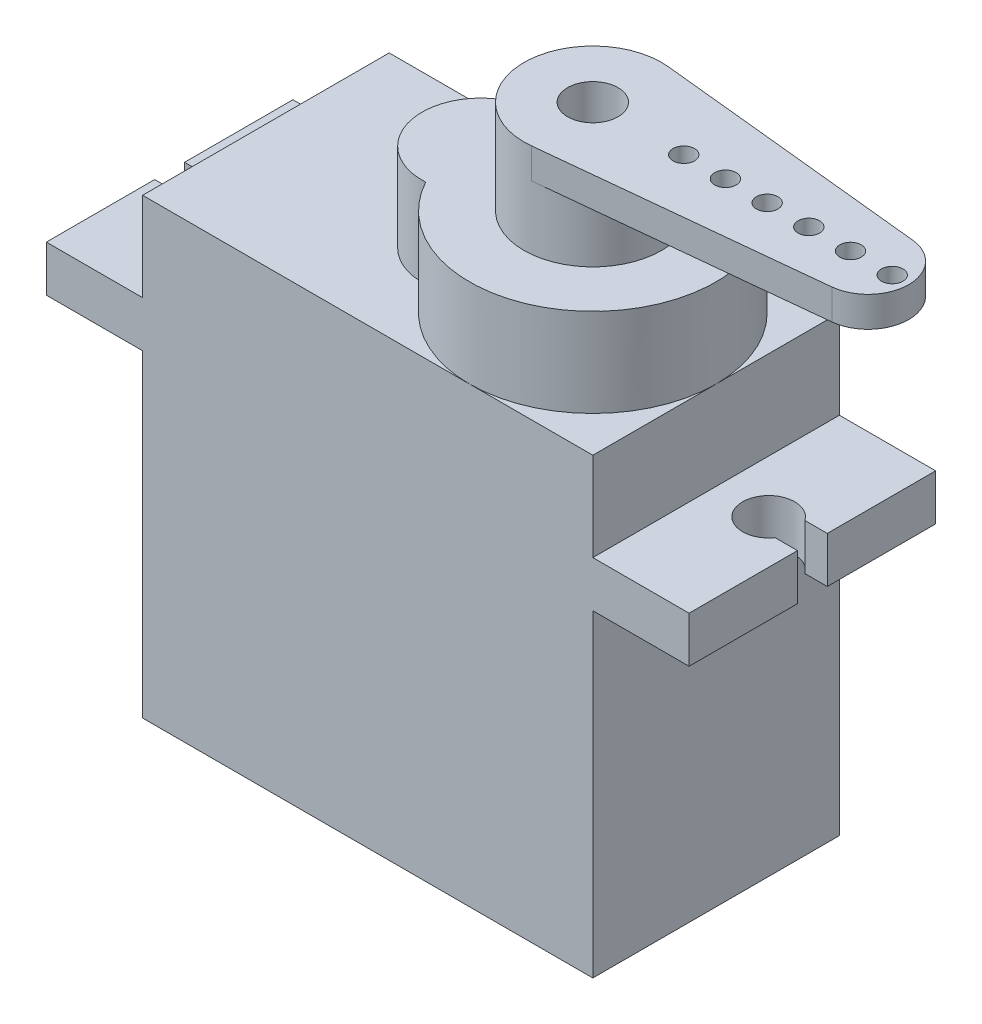
ISO-10303-21;
HEADER;
FILE_DESCRIPTION(('STEP AP214'),'2;1');
FILE_NAME('part.step','',(''),(''),'','','');
FILE_SCHEMA(('AUTOMOTIVE_DESIGN { 1 0 10303 214 1 1 1 1 }'));
ENDSEC;
DATA;
#1=APPLICATION_CONTEXT('core data for automotive mechanical design processes');
#2=APPLICATION_PROTOCOL_DEFINITION('international standard','automotive_design',2000,#1);
#3=PRODUCT_CONTEXT('',#1,'mechanical');
#4=PRODUCT('Part','Part','',(#3));
#5=PRODUCT_RELATED_PRODUCT_CATEGORY('part','',(#4));
#6=PRODUCT_DEFINITION_FORMATION('','',#4);
#7=PRODUCT_DEFINITION_CONTEXT('part definition',#1,'design');
#8=PRODUCT_DEFINITION('design','',#6,#7);
#9=PRODUCT_DEFINITION_SHAPE('','',#8);
#10=(LENGTH_UNIT() NAMED_UNIT(*) SI_UNIT(.MILLI.,.METRE.));
#11=(NAMED_UNIT(*) PLANE_ANGLE_UNIT() SI_UNIT($,.RADIAN.));
#12=(NAMED_UNIT(*) SI_UNIT($,.STERADIAN.) SOLID_ANGLE_UNIT());
#13=UNCERTAINTY_MEASURE_WITH_UNIT(LENGTH_MEASURE(1.E-05),#10,'distance_accuracy_value','');
#14=(GEOMETRIC_REPRESENTATION_CONTEXT(3) GLOBAL_UNCERTAINTY_ASSIGNED_CONTEXT((#13)) GLOBAL_UNIT_ASSIGNED_CONTEXT((#10,
#11,#12)) REPRESENTATION_CONTEXT('',''));
#15=CARTESIAN_POINT('',(0.,0.,0.));
#16=DIRECTION('',(0.,0.,1.));
#17=DIRECTION('',(1.,0.,0.));
#18=AXIS2_PLACEMENT_3D('',#15,#16,#17);
#19=CARTESIAN_POINT('',(11.3157,22.7584,6.1976));
#20=DIRECTION('',(-1.,0.,0.));
#21=DIRECTION('',(0.,0.,1.));
#22=AXIS2_PLACEMENT_3D('',#19,#20,#21);
#23=PLANE('',#22);
#24=DIRECTION('',(0.,0.,-1.));
#25=VECTOR('',#24,1.);
#26=CARTESIAN_POINT('',(11.3157,15.9893,6.1976));
#27=LINE('',#26,#25);
#28=CARTESIAN_POINT('',(11.3157,15.9893,6.1976));
#29=VERTEX_POINT('',#28);
#30=CARTESIAN_POINT('',(11.3157,15.9893,-6.1976));
#31=VERTEX_POINT('',#30);
#32=EDGE_CURVE('E242',#29,#31,#27,.T.);
#33=ORIENTED_EDGE('',*,*,#32,.F.);
#34=DIRECTION('',(0.,-1.,0.));
#35=VECTOR('',#34,1.);
#36=CARTESIAN_POINT('',(11.3157,22.7584,6.1976));
#37=LINE('',#36,#35);
#38=CARTESIAN_POINT('',(11.3157,0.,6.1976));
#39=VERTEX_POINT('',#38);
#40=EDGE_CURVE('E444',#29,#39,#37,.T.);
#41=ORIENTED_EDGE('',*,*,#40,.T.);
#42=DIRECTION('',(0.,0.,-1.));
#43=VECTOR('',#42,1.);
#44=CARTESIAN_POINT('',(11.3157,0.,6.1976));
#45=LINE('',#44,#43);
#46=CARTESIAN_POINT('',(11.3157,0.,-6.1976));
#47=VERTEX_POINT('',#46);
#48=EDGE_CURVE('E429',#39,#47,#45,.T.);
#49=ORIENTED_EDGE('',*,*,#48,.T.);
#50=DIRECTION('',(0.,-1.,0.));
#51=VECTOR('',#50,1.);
#52=CARTESIAN_POINT('',(11.3157,22.7584,-6.1976));
#53=LINE('',#52,#51);
#54=EDGE_CURVE('E466',#31,#47,#53,.T.);
#55=ORIENTED_EDGE('',*,*,#54,.F.);
#56=EDGE_LOOP('',(#33,#41,#49,#55));
#57=FACE_BOUND('',#56,.T.);
#58=ADVANCED_FACE('F41',(#57),#23,.F.);
#59=CARTESIAN_POINT('',(-11.3157,22.7584,6.1976));
#60=DIRECTION('',(1.,0.,0.));
#61=DIRECTION('',(0.,0.,-1.));
#62=AXIS2_PLACEMENT_3D('',#59,#60,#61);
#63=PLANE('',#62);
#64=DIRECTION('',(0.,0.,1.));
#65=VECTOR('',#64,1.);
#66=CARTESIAN_POINT('',(-11.3157,15.9893,6.1976));
#67=LINE('',#66,#65);
#68=CARTESIAN_POINT('',(-11.3157,15.9893,-6.1976));
#69=VERTEX_POINT('',#68);
#70=CARTESIAN_POINT('',(-11.3157,15.9893,6.1976));
#71=VERTEX_POINT('',#70);
#72=EDGE_CURVE('E339',#69,#71,#67,.T.);
#73=ORIENTED_EDGE('',*,*,#72,.F.);
#74=DIRECTION('',(0.,-1.,0.));
#75=VECTOR('',#74,1.);
#76=CARTESIAN_POINT('',(-11.3157,22.7584,-6.1976));
#77=LINE('',#76,#75);
#78=CARTESIAN_POINT('',(-11.3157,0.,-6.1976));
#79=VERTEX_POINT('',#78);
#80=EDGE_CURVE('E463',#69,#79,#77,.T.);
#81=ORIENTED_EDGE('',*,*,#80,.T.);
#82=DIRECTION('',(0.,0.,1.));
#83=VECTOR('',#82,1.);
#84=CARTESIAN_POINT('',(-11.3157,0.,6.1976));
#85=LINE('',#84,#83);
#86=CARTESIAN_POINT('',(-11.3157,0.,6.1976));
#87=VERTEX_POINT('',#86);
#88=EDGE_CURVE('E450',#79,#87,#85,.T.);
#89=ORIENTED_EDGE('',*,*,#88,.T.);
#90=DIRECTION('',(0.,-1.,0.));
#91=VECTOR('',#90,1.);
#92=CARTESIAN_POINT('',(-11.3157,22.7584,6.1976));
#93=LINE('',#92,#91);
#94=EDGE_CURVE('E459',#71,#87,#93,.T.);
#95=ORIENTED_EDGE('',*,*,#94,.F.);
#96=EDGE_LOOP('',(#73,#81,#89,#95));
#97=FACE_BOUND('',#96,.T.);
#98=ADVANCED_FACE('F487',(#97),#63,.F.);
#99=CARTESIAN_POINT('',(0.,22.7584,0.));
#100=DIRECTION('',(0.,-1.,0.));
#101=DIRECTION('',(0.,0.,-1.));
#102=AXIS2_PLACEMENT_3D('',#99,#100,#101);
#103=PLANE('',#102);
#104=CARTESIAN_POINT('',(-0.507999999999997,22.7584,0.));
#105=DIRECTION('',(0.,1.,0.));
#106=DIRECTION('',(0.,0.,1.));
#107=AXIS2_PLACEMENT_3D('',#104,#105,#106);
#108=CIRCLE('',#107,2.9591);
#109=CARTESIAN_POINT('',(-0.330343340857782,22.7584,-2.95376216399738));
#110=VERTEX_POINT('',#109);
#111=CARTESIAN_POINT('',(-0.330343340857786,22.7584,2.95376216399737));
#112=VERTEX_POINT('',#111);
#113=EDGE_CURVE('E408',#110,#112,#108,.T.);
#114=ORIENTED_EDGE('',*,*,#113,.F.);
#115=CARTESIAN_POINT('',(5.1181,22.7584,0.));
#116=DIRECTION('',(0.,1.,0.));
#117=DIRECTION('',(0.,0.,1.));
#118=AXIS2_PLACEMENT_3D('',#115,#116,#117);
#119=CIRCLE('',#118,6.1976);
#120=CARTESIAN_POINT('',(5.1181,22.7584,-6.1976));
#121=VERTEX_POINT('',#120);
#122=EDGE_CURVE('E423',#121,#110,#119,.T.);
#123=ORIENTED_EDGE('',*,*,#122,.F.);
#124=DIRECTION('',(-1.,0.,0.));
#125=VECTOR('',#124,1.);
#126=CARTESIAN_POINT('',(-11.3157,22.7584,-6.1976));
#127=LINE('',#126,#125);
#128=CARTESIAN_POINT('',(-11.3157,22.7584,-6.1976));
#129=VERTEX_POINT('',#128);
#130=EDGE_CURVE('E433',#121,#129,#127,.T.);
#131=ORIENTED_EDGE('',*,*,#130,.T.);
#132=DIRECTION('',(0.,0.,1.));
#133=VECTOR('',#132,1.);
#134=CARTESIAN_POINT('',(-11.3157,22.7584,6.1976));
#135=LINE('',#134,#133);
#136=CARTESIAN_POINT('',(-11.3157,22.7584,6.1976));
#137=VERTEX_POINT('',#136);
#138=EDGE_CURVE('E438',#129,#137,#135,.T.);
#139=ORIENTED_EDGE('',*,*,#138,.T.);
#140=DIRECTION('',(1.,0.,0.));
#141=VECTOR('',#140,1.);
#142=CARTESIAN_POINT('',(-11.3157,22.7584,6.1976));
#143=LINE('',#142,#141);
#144=CARTESIAN_POINT('',(5.1181,22.7584,6.1976));
#145=VERTEX_POINT('',#144);
#146=EDGE_CURVE('E441',#137,#145,#143,.T.);
#147=ORIENTED_EDGE('',*,*,#146,.T.);
#148=EDGE_CURVE('E416',#112,#145,#119,.T.);
#149=ORIENTED_EDGE('',*,*,#148,.F.);
#150=EDGE_LOOP('',(#114,#123,#131,#139,#147,#149));
#151=FACE_BOUND('',#150,.T.);
#152=ADVANCED_FACE('F512',(#151),#103,.F.);
#153=CARTESIAN_POINT('',(11.3157,22.7584,0.));
#154=VERTEX_POINT('',#153);
#155=EDGE_CURVE('E411',#145,#154,#119,.T.);
#156=ORIENTED_EDGE('',*,*,#155,.F.);
#157=CARTESIAN_POINT('',(11.3157,22.7584,6.1976));
#158=VERTEX_POINT('',#157);
#159=EDGE_CURVE('E440',#145,#158,#143,.T.);
#160=ORIENTED_EDGE('',*,*,#159,.T.);
#161=DIRECTION('',(0.,0.,-1.));
#162=VECTOR('',#161,1.);
#163=CARTESIAN_POINT('',(11.3157,22.7584,6.1976));
#164=LINE('',#163,#162);
#165=EDGE_CURVE('E430',#158,#154,#164,.T.);
#166=ORIENTED_EDGE('',*,*,#165,.T.);
#167=EDGE_LOOP('',(#156,#160,#166));
#168=FACE_BOUND('',#167,.T.);
#169=ADVANCED_FACE('F523',(#168),#103,.F.);
#170=CARTESIAN_POINT('',(11.3157,18.3007,6.1976));
#171=VERTEX_POINT('',#170);
#172=EDGE_CURVE('E456',#158,#171,#37,.T.);
#173=ORIENTED_EDGE('',*,*,#172,.T.);
#174=DIRECTION('',(0.,0.,-1.));
#175=VECTOR('',#174,1.);
#176=CARTESIAN_POINT('',(11.3157,18.3007,6.1976));
#177=LINE('',#176,#175);
#178=CARTESIAN_POINT('',(11.3157,18.3007,-6.1976));
#179=VERTEX_POINT('',#178);
#180=EDGE_CURVE('E337',#171,#179,#177,.T.);
#181=ORIENTED_EDGE('',*,*,#180,.T.);
#182=CARTESIAN_POINT('',(11.3157,22.7584,-6.1976));
#183=VERTEX_POINT('',#182);
#184=EDGE_CURVE('E467',#183,#179,#53,.T.);
#185=ORIENTED_EDGE('',*,*,#184,.F.);
#186=EDGE_CURVE('E434',#154,#183,#164,.T.);
#187=ORIENTED_EDGE('',*,*,#186,.F.);
#188=ORIENTED_EDGE('',*,*,#165,.F.);
#189=EDGE_LOOP('',(#173,#181,#185,#187,#188));
#190=FACE_BOUND('',#189,.T.);
#191=ADVANCED_FACE('F43',(#190),#23,.F.);
#192=CARTESIAN_POINT('',(-11.3157,22.7584,-6.1976));
#193=DIRECTION('',(0.,0.,1.));
#194=DIRECTION('',(1.,0.,0.));
#195=AXIS2_PLACEMENT_3D('',#192,#193,#194);
#196=PLANE('',#195);
#197=ORIENTED_EDGE('',*,*,#184,.T.);
#198=DIRECTION('',(-1.,0.,0.));
#199=VECTOR('',#198,1.);
#200=CARTESIAN_POINT('',(-16.1544,18.3007,-6.1976));
#201=LINE('',#200,#199);
#202=CARTESIAN_POINT('',(16.1544,18.3007,-6.1976));
#203=VERTEX_POINT('',#202);
#204=EDGE_CURVE('E56',#203,#179,#201,.T.);
#205=ORIENTED_EDGE('',*,*,#204,.F.);
#206=DIRECTION('',(0.,1.,0.));
#207=VECTOR('',#206,1.);
#208=CARTESIAN_POINT('',(16.1544,15.9893,-6.1976));
#209=LINE('',#208,#207);
#210=CARTESIAN_POINT('',(16.1544,15.9893,-6.1976));
#211=VERTEX_POINT('',#210);
#212=EDGE_CURVE('E223',#211,#203,#209,.T.);
#213=ORIENTED_EDGE('',*,*,#212,.F.);
#214=DIRECTION('',(-1.,0.,0.));
#215=VECTOR('',#214,1.);
#216=CARTESIAN_POINT('',(-16.1544,15.9893,-6.1976));
#217=LINE('',#216,#215);
#218=EDGE_CURVE('E227',#211,#31,#217,.T.);
#219=ORIENTED_EDGE('',*,*,#218,.T.);
#220=ORIENTED_EDGE('',*,*,#54,.T.);
#221=DIRECTION('',(-1.,0.,0.));
#222=VECTOR('',#221,1.);
#223=CARTESIAN_POINT('',(-11.3157,0.,-6.1976));
#224=LINE('',#223,#222);
#225=EDGE_CURVE('E447',#47,#79,#224,.T.);
#226=ORIENTED_EDGE('',*,*,#225,.T.);
#227=ORIENTED_EDGE('',*,*,#80,.F.);
#228=CARTESIAN_POINT('',(-16.1544,15.9893,-6.1976));
#229=VERTEX_POINT('',#228);
#230=EDGE_CURVE('E244',#69,#229,#217,.T.);
#231=ORIENTED_EDGE('',*,*,#230,.T.);
#232=DIRECTION('',(0.,1.,0.));
#233=VECTOR('',#232,1.);
#234=CARTESIAN_POINT('',(-16.1544,15.9893,-6.1976));
#235=LINE('',#234,#233);
#236=CARTESIAN_POINT('',(-16.1544,18.3007,-6.1976));
#237=VERTEX_POINT('',#236);
#238=EDGE_CURVE('E232',#229,#237,#235,.T.);
#239=ORIENTED_EDGE('',*,*,#238,.T.);
#240=CARTESIAN_POINT('',(-11.3157,18.3007,-6.1976));
#241=VERTEX_POINT('',#240);
#242=EDGE_CURVE('E287',#241,#237,#201,.T.);
#243=ORIENTED_EDGE('',*,*,#242,.F.);
#244=EDGE_CURVE('E464',#129,#241,#77,.T.);
#245=ORIENTED_EDGE('',*,*,#244,.F.);
#246=ORIENTED_EDGE('',*,*,#130,.F.);
#247=EDGE_CURVE('E435',#183,#121,#127,.T.);
#248=ORIENTED_EDGE('',*,*,#247,.F.);
#249=EDGE_LOOP('',(#197,#205,#213,#219,#220,#226,#227,#231,#239,#243,#245,#246,#248));
#250=FACE_BOUND('',#249,.T.);
#251=ADVANCED_FACE('F226',(#250),#196,.F.);
#252=ORIENTED_EDGE('',*,*,#244,.T.);
#253=DIRECTION('',(0.,0.,1.));
#254=VECTOR('',#253,1.);
#255=CARTESIAN_POINT('',(-11.3157,18.3007,6.1976));
#256=LINE('',#255,#254);
#257=CARTESIAN_POINT('',(-11.3157,18.3007,6.1976));
#258=VERTEX_POINT('',#257);
#259=EDGE_CURVE('E314',#241,#258,#256,.T.);
#260=ORIENTED_EDGE('',*,*,#259,.T.);
#261=EDGE_CURVE('E460',#137,#258,#93,.T.);
#262=ORIENTED_EDGE('',*,*,#261,.F.);
#263=ORIENTED_EDGE('',*,*,#138,.F.);
#264=EDGE_LOOP('',(#252,#260,#262,#263));
#265=FACE_BOUND('',#264,.T.);
#266=ADVANCED_FACE('F508',(#265),#63,.F.);
#267=CARTESIAN_POINT('',(-11.3157,22.7584,6.1976));
#268=DIRECTION('',(0.,0.,-1.));
#269=DIRECTION('',(-1.,0.,0.));
#270=AXIS2_PLACEMENT_3D('',#267,#268,#269);
#271=PLANE('',#270);
#272=ORIENTED_EDGE('',*,*,#261,.T.);
#273=DIRECTION('',(1.,0.,0.));
#274=VECTOR('',#273,1.);
#275=CARTESIAN_POINT('',(-16.1544,18.3007,6.1976));
#276=LINE('',#275,#274);
#277=CARTESIAN_POINT('',(-16.1544,18.3007,6.1976));
#278=VERTEX_POINT('',#277);
#279=EDGE_CURVE('E64',#278,#258,#276,.T.);
#280=ORIENTED_EDGE('',*,*,#279,.F.);
#281=DIRECTION('',(0.,1.,0.));
#282=VECTOR('',#281,1.);
#283=CARTESIAN_POINT('',(-16.1544,15.9893,6.1976));
#284=LINE('',#283,#282);
#285=CARTESIAN_POINT('',(-16.1544,15.9893,6.1976));
#286=VERTEX_POINT('',#285);
#287=EDGE_CURVE('E324',#286,#278,#284,.T.);
#288=ORIENTED_EDGE('',*,*,#287,.F.);
#289=DIRECTION('',(1.,0.,0.));
#290=VECTOR('',#289,1.);
#291=CARTESIAN_POINT('',(-16.1544,15.9893,6.1976));
#292=LINE('',#291,#290);
#293=EDGE_CURVE('E272',#286,#71,#292,.T.);
#294=ORIENTED_EDGE('',*,*,#293,.T.);
#295=ORIENTED_EDGE('',*,*,#94,.T.);
#296=DIRECTION('',(1.,0.,0.));
#297=VECTOR('',#296,1.);
#298=CARTESIAN_POINT('',(-11.3157,0.,6.1976));
#299=LINE('',#298,#297);
#300=EDGE_CURVE('E453',#87,#39,#299,.T.);
#301=ORIENTED_EDGE('',*,*,#300,.T.);
#302=ORIENTED_EDGE('',*,*,#40,.F.);
#303=CARTESIAN_POINT('',(16.1544,15.9893,6.1976));
#304=VERTEX_POINT('',#303);
#305=EDGE_CURVE('E271',#29,#304,#292,.T.);
#306=ORIENTED_EDGE('',*,*,#305,.T.);
#307=DIRECTION('',(0.,1.,0.));
#308=VECTOR('',#307,1.);
#309=CARTESIAN_POINT('',(16.1544,15.9893,6.1976));
#310=LINE('',#309,#308);
#311=CARTESIAN_POINT('',(16.1544,18.3007,6.1976));
#312=VERTEX_POINT('',#311);
#313=EDGE_CURVE('E321',#304,#312,#310,.T.);
#314=ORIENTED_EDGE('',*,*,#313,.T.);
#315=EDGE_CURVE('E303',#171,#312,#276,.T.);
#316=ORIENTED_EDGE('',*,*,#315,.F.);
#317=ORIENTED_EDGE('',*,*,#172,.F.);
#318=ORIENTED_EDGE('',*,*,#159,.F.);
#319=ORIENTED_EDGE('',*,*,#146,.F.);
#320=EDGE_LOOP('',(#272,#280,#288,#294,#295,#301,#302,#306,#314,#316,#317,#318,#319));
#321=FACE_BOUND('',#320,.T.);
#322=ADVANCED_FACE('F482',(#321),#271,.F.);
#323=EDGE_CURVE('E471',#154,#121,#119,.T.);
#324=ORIENTED_EDGE('',*,*,#323,.F.);
#325=ORIENTED_EDGE('',*,*,#186,.T.);
#326=ORIENTED_EDGE('',*,*,#247,.T.);
#327=EDGE_LOOP('',(#324,#325,#326));
#328=FACE_BOUND('',#327,.T.);
#329=ADVANCED_FACE('F515',(#328),#103,.F.);
#330=CARTESIAN_POINT('',(0.,0.,0.));
#331=DIRECTION('',(0.,-1.,0.));
#332=DIRECTION('',(0.,0.,-1.));
#333=AXIS2_PLACEMENT_3D('',#330,#331,#332);
#334=PLANE('',#333);
#335=ORIENTED_EDGE('',*,*,#48,.F.);
#336=ORIENTED_EDGE('',*,*,#300,.F.);
#337=ORIENTED_EDGE('',*,*,#88,.F.);
#338=ORIENTED_EDGE('',*,*,#225,.F.);
#339=EDGE_LOOP('',(#335,#336,#337,#338));
#340=FACE_BOUND('',#339,.T.);
#341=ADVANCED_FACE('F478',(#340),#334,.T.);
#342=CARTESIAN_POINT('',(-0.507999999999997,27.2034,0.));
#343=DIRECTION('',(0.,-1.,0.));
#344=DIRECTION('',(0.,0.,-1.));
#345=AXIS2_PLACEMENT_3D('',#342,#343,#344);
#346=CYLINDRICAL_SURFACE('',#345,2.9591);
#347=ORIENTED_EDGE('',*,*,#113,.T.);
#348=DIRECTION('',(0.,-1.,0.));
#349=VECTOR('',#348,1.);
#350=CARTESIAN_POINT('',(-0.330343340857786,27.2034,2.95376216399737));
#351=LINE('',#350,#349);
#352=CARTESIAN_POINT('',(-0.330343340857786,27.2034,2.95376216399737));
#353=VERTEX_POINT('',#352);
#354=EDGE_CURVE('E426',#353,#112,#351,.T.);
#355=ORIENTED_EDGE('',*,*,#354,.F.);
#356=CARTESIAN_POINT('',(-0.507999999999997,27.2034,0.));
#357=DIRECTION('',(0.,1.,0.));
#358=DIRECTION('',(0.,0.,1.));
#359=AXIS2_PLACEMENT_3D('',#356,#357,#358);
#360=CIRCLE('',#359,2.9591);
#361=CARTESIAN_POINT('',(-0.330343340857782,27.2034,-2.95376216399738));
#362=VERTEX_POINT('',#361);
#363=EDGE_CURVE('E412',#362,#353,#360,.T.);
#364=ORIENTED_EDGE('',*,*,#363,.F.);
#365=DIRECTION('',(0.,-1.,0.));
#366=VECTOR('',#365,1.);
#367=CARTESIAN_POINT('',(-0.330343340857782,27.2034,-2.95376216399738));
#368=LINE('',#367,#366);
#369=EDGE_CURVE('E418',#362,#110,#368,.T.);
#370=ORIENTED_EDGE('',*,*,#369,.T.);
#371=EDGE_LOOP('',(#347,#355,#364,#370));
#372=FACE_BOUND('',#371,.T.);
#373=ADVANCED_FACE('F575',(#372),#346,.T.);
#374=CARTESIAN_POINT('',(5.1181,27.2034,0.));
#375=DIRECTION('',(0.,-1.,0.));
#376=DIRECTION('',(0.,0.,-1.));
#377=AXIS2_PLACEMENT_3D('',#374,#375,#376);
#378=CYLINDRICAL_SURFACE('',#377,6.1976);
#379=ORIENTED_EDGE('',*,*,#148,.T.);
#380=ORIENTED_EDGE('',*,*,#155,.T.);
#381=ORIENTED_EDGE('',*,*,#323,.T.);
#382=ORIENTED_EDGE('',*,*,#122,.T.);
#383=ORIENTED_EDGE('',*,*,#369,.F.);
#384=CARTESIAN_POINT('',(5.1181,27.2034,0.));
#385=DIRECTION('',(0.,1.,0.));
#386=DIRECTION('',(0.,0.,1.));
#387=AXIS2_PLACEMENT_3D('',#384,#385,#386);
#388=CIRCLE('',#387,6.1976);
#389=EDGE_CURVE('E415',#353,#362,#388,.T.);
#390=ORIENTED_EDGE('',*,*,#389,.F.);
#391=ORIENTED_EDGE('',*,*,#354,.T.);
#392=EDGE_LOOP('',(#379,#380,#381,#382,#383,#390,#391));
#393=FACE_BOUND('',#392,.T.);
#394=ADVANCED_FACE('F519',(#393),#378,.T.);
#395=CARTESIAN_POINT('',(0.,27.2034,0.));
#396=DIRECTION('',(0.,1.,0.));
#397=DIRECTION('',(0.,0.,1.));
#398=AXIS2_PLACEMENT_3D('',#395,#396,#397);
#399=PLANE('',#398);
#400=CARTESIAN_POINT('',(5.1181,27.2034,0.));
#401=DIRECTION('',(0.,1.,0.));
#402=DIRECTION('',(0.,0.,1.));
#403=AXIS2_PLACEMENT_3D('',#400,#401,#402);
#404=CIRCLE('',#403,3.46075);
#405=CARTESIAN_POINT('',(5.1181,27.2034,3.46075));
#406=VERTEX_POINT('',#405);
#407=EDGE_CURVE('E49',#406,#406,#404,.T.);
#408=ORIENTED_EDGE('',*,*,#407,.F.);
#409=EDGE_LOOP('',(#408));
#410=FACE_BOUND('',#409,.T.);
#411=ORIENTED_EDGE('',*,*,#363,.T.);
#412=ORIENTED_EDGE('',*,*,#389,.T.);
#413=EDGE_LOOP('',(#411,#412));
#414=FACE_BOUND('',#413,.T.);
#415=ADVANCED_FACE('F815',(#410,#414),#399,.T.);
#416=CARTESIAN_POINT('',(5.1181,31.9278,0.));
#417=DIRECTION('',(0.,-1.,0.));
#418=DIRECTION('',(0.,0.,-1.));
#419=AXIS2_PLACEMENT_3D('',#416,#417,#418);
#420=CYLINDRICAL_SURFACE('',#419,3.46075);
#421=CARTESIAN_POINT('',(5.1181,31.9278,0.));
#422=DIRECTION('',(0.,1.,0.));
#423=DIRECTION('',(0.,0.,1.));
#424=AXIS2_PLACEMENT_3D('',#421,#422,#423);
#425=CIRCLE('',#424,3.46075);
#426=CARTESIAN_POINT('',(5.47227496558054,31.9278,-3.44257907044356));
#427=VERTEX_POINT('',#426);
#428=CARTESIAN_POINT('',(5.47227496558054,31.9278,3.44257907044356));
#429=VERTEX_POINT('',#428);
#430=EDGE_CURVE('E399',#427,#429,#425,.T.);
#431=ORIENTED_EDGE('',*,*,#430,.F.);
#432=DIRECTION('',(0.,1.,0.));
#433=VECTOR('',#432,1.);
#434=CARTESIAN_POINT('',(5.47227496558054,30.4038,-3.44257907044356));
#435=LINE('',#434,#433);
#436=CARTESIAN_POINT('',(5.47227496558054,30.4038,-3.44257907044356));
#437=VERTEX_POINT('',#436);
#438=EDGE_CURVE('E396',#437,#427,#435,.T.);
#439=ORIENTED_EDGE('',*,*,#438,.F.);
#440=CARTESIAN_POINT('',(5.1181,30.4038,0.));
#441=DIRECTION('',(0.,1.,0.));
#442=DIRECTION('',(0.,0.,1.));
#443=AXIS2_PLACEMENT_3D('',#440,#441,#442);
#444=CIRCLE('',#443,3.46075);
#445=CARTESIAN_POINT('',(5.47227496558054,30.4038,3.44257907044356));
#446=VERTEX_POINT('',#445);
#447=EDGE_CURVE('E11',#446,#437,#444,.T.);
#448=ORIENTED_EDGE('',*,*,#447,.F.);
#449=DIRECTION('',(0.,1.,0.));
#450=VECTOR('',#449,1.);
#451=CARTESIAN_POINT('',(5.47227496558054,30.4038,3.44257907044356));
#452=LINE('',#451,#450);
#453=EDGE_CURVE('E389',#446,#429,#452,.T.);
#454=ORIENTED_EDGE('',*,*,#453,.T.);
#455=EDGE_LOOP('',(#431,#439,#448,#454));
#456=FACE_BOUND('',#455,.T.);
#457=ORIENTED_EDGE('',*,*,#407,.T.);
#458=EDGE_LOOP('',(#457));
#459=FACE_BOUND('',#458,.T.);
#460=ADVANCED_FACE('F756',(#456,#459),#420,.T.);
#461=CARTESIAN_POINT('',(5.1181,31.9278,0.));
#462=DIRECTION('',(0.,1.,0.));
#463=DIRECTION('',(0.,0.,1.));
#464=AXIS2_PLACEMENT_3D('',#461,#462,#463);
#465=PLANE('',#464);
#466=CARTESIAN_POINT('',(5.1181,31.9278,0.));
#467=DIRECTION('',(0.,1.,0.));
#468=DIRECTION('',(0.,0.,1.));
#469=AXIS2_PLACEMENT_3D('',#466,#467,#468);
#470=CIRCLE('',#469,1.27);
#471=CARTESIAN_POINT('',(5.1181,31.9278,1.27));
#472=VERTEX_POINT('',#471);
#473=EDGE_CURVE('E748',#472,#472,#470,.T.);
#474=ORIENTED_EDGE('',*,*,#473,.F.);
#475=EDGE_LOOP('',(#474));
#476=FACE_BOUND('',#475,.T.);
#477=ORIENTED_EDGE('',*,*,#430,.T.);
#478=DIRECTION('',(0.994749424385915,0.,-0.102340523175769));
#479=VECTOR('',#478,1.);
#480=CARTESIAN_POINT('',(5.47227496558054,31.9278,3.44257907044356));
#481=LINE('',#480,#479);
#482=CARTESIAN_POINT('',(19.1640056677375,31.9278,2.03396414804188));
#483=VERTEX_POINT('',#482);
#484=EDGE_CURVE('E376',#429,#483,#481,.T.);
#485=ORIENTED_EDGE('',*,*,#484,.T.);
#486=CARTESIAN_POINT('',(18.95475,31.9278,0.));
#487=DIRECTION('',(0.,1.,0.));
#488=DIRECTION('',(0.,0.,1.));
#489=AXIS2_PLACEMENT_3D('',#486,#487,#488);
#490=CIRCLE('',#489,2.0447);
#491=CARTESIAN_POINT('',(19.1640056677375,31.9278,-2.03396414804188));
#492=VERTEX_POINT('',#491);
#493=EDGE_CURVE('E392',#483,#492,#490,.T.);
#494=ORIENTED_EDGE('',*,*,#493,.T.);
#495=DIRECTION('',(-0.994749424385915,0.,-0.102340523175769));
#496=VECTOR('',#495,1.);
#497=CARTESIAN_POINT('',(5.47227496558054,31.9278,-3.44257907044356));
#498=LINE('',#497,#496);
#499=EDGE_CURVE('E383',#492,#427,#498,.T.);
#500=ORIENTED_EDGE('',*,*,#499,.T.);
#501=EDGE_LOOP('',(#477,#485,#494,#500));
#502=FACE_BOUND('',#501,.T.);
#503=CARTESIAN_POINT('',(9.6901,31.9278,0.));
#504=DIRECTION('',(0.,1.,0.));
#505=DIRECTION('',(0.,0.,1.));
#506=AXIS2_PLACEMENT_3D('',#503,#504,#505);
#507=CIRCLE('',#506,0.53975);
#508=CARTESIAN_POINT('',(9.6901,31.9278,0.53975));
#509=VERTEX_POINT('',#508);
#510=EDGE_CURVE('E370',#509,#509,#507,.T.);
#511=ORIENTED_EDGE('',*,*,#510,.F.);
#512=EDGE_LOOP('',(#511));
#513=FACE_BOUND('',#512,.T.);
#514=CARTESIAN_POINT('',(11.7856,31.9278,0.));
#515=DIRECTION('',(0.,1.,0.));
#516=DIRECTION('',(0.,0.,1.));
#517=AXIS2_PLACEMENT_3D('',#514,#515,#516);
#518=CIRCLE('',#517,0.539749999999999);
#519=CARTESIAN_POINT('',(11.7856,31.9278,0.539749999999999));
#520=VERTEX_POINT('',#519);
#521=EDGE_CURVE('E364',#520,#520,#518,.T.);
#522=ORIENTED_EDGE('',*,*,#521,.F.);
#523=EDGE_LOOP('',(#522));
#524=FACE_BOUND('',#523,.T.);
#525=CARTESIAN_POINT('',(13.8811,31.9278,0.));
#526=DIRECTION('',(0.,1.,0.));
#527=DIRECTION('',(0.,0.,1.));
#528=AXIS2_PLACEMENT_3D('',#525,#526,#527);
#529=CIRCLE('',#528,0.53975);
#530=CARTESIAN_POINT('',(13.8811,31.9278,0.539750000000001));
#531=VERTEX_POINT('',#530);
#532=EDGE_CURVE('E358',#531,#531,#529,.T.);
#533=ORIENTED_EDGE('',*,*,#532,.F.);
#534=EDGE_LOOP('',(#533));
#535=FACE_BOUND('',#534,.T.);
#536=CARTESIAN_POINT('',(15.9766,31.9278,0.));
#537=DIRECTION('',(0.,1.,0.));
#538=DIRECTION('',(0.,0.,1.));
#539=AXIS2_PLACEMENT_3D('',#536,#537,#538);
#540=CIRCLE('',#539,0.539750000000002);
#541=CARTESIAN_POINT('',(15.9766,31.9278,0.539750000000002));
#542=VERTEX_POINT('',#541);
#543=EDGE_CURVE('E352',#542,#542,#540,.T.);
#544=ORIENTED_EDGE('',*,*,#543,.F.);
#545=EDGE_LOOP('',(#544));
#546=FACE_BOUND('',#545,.T.);
#547=CARTESIAN_POINT('',(18.0721,31.9278,0.));
#548=DIRECTION('',(0.,1.,0.));
#549=DIRECTION('',(0.,0.,1.));
#550=AXIS2_PLACEMENT_3D('',#547,#548,#549);
#551=CIRCLE('',#550,0.539749999999999);
#552=CARTESIAN_POINT('',(18.0721,31.9278,0.539749999999999));
#553=VERTEX_POINT('',#552);
#554=EDGE_CURVE('E346',#553,#553,#551,.T.);
#555=ORIENTED_EDGE('',*,*,#554,.F.);
#556=EDGE_LOOP('',(#555));
#557=FACE_BOUND('',#556,.T.);
#558=CARTESIAN_POINT('',(20.1676,31.9278,0.));
#559=DIRECTION('',(0.,1.,0.));
#560=DIRECTION('',(0.,0.,1.));
#561=AXIS2_PLACEMENT_3D('',#558,#559,#560);
#562=CIRCLE('',#561,0.539749999999999);
#563=CARTESIAN_POINT('',(20.1676,31.9278,0.539749999999999));
#564=VERTEX_POINT('',#563);
#565=EDGE_CURVE('E342',#564,#564,#562,.T.);
#566=ORIENTED_EDGE('',*,*,#565,.F.);
#567=EDGE_LOOP('',(#566));
#568=FACE_BOUND('',#567,.T.);
#569=ADVANCED_FACE('F753',(#476,#502,#513,#524,#535,#546,#557,#568),#465,.T.);
#570=CARTESIAN_POINT('',(5.1181,30.4038,0.));
#571=DIRECTION('',(0.,1.,0.));
#572=DIRECTION('',(0.,0.,1.));
#573=AXIS2_PLACEMENT_3D('',#570,#571,#572);
#574=PLANE('',#573);
#575=CARTESIAN_POINT('',(20.1676,30.4038,0.));
#576=DIRECTION('',(0.,1.,0.));
#577=DIRECTION('',(0.,0.,1.));
#578=AXIS2_PLACEMENT_3D('',#575,#576,#577);
#579=CIRCLE('',#578,0.539749999999999);
#580=CARTESIAN_POINT('',(20.1676,30.4038,0.539749999999999));
#581=VERTEX_POINT('',#580);
#582=EDGE_CURVE('E343',#581,#581,#579,.T.);
#583=ORIENTED_EDGE('',*,*,#582,.T.);
#584=EDGE_LOOP('',(#583));
#585=FACE_BOUND('',#584,.T.);
#586=CARTESIAN_POINT('',(18.0721,30.4038,0.));
#587=DIRECTION('',(0.,1.,0.));
#588=DIRECTION('',(0.,0.,1.));
#589=AXIS2_PLACEMENT_3D('',#586,#587,#588);
#590=CIRCLE('',#589,0.539749999999999);
#591=CARTESIAN_POINT('',(18.0721,30.4038,0.539749999999999));
#592=VERTEX_POINT('',#591);
#593=EDGE_CURVE('E349',#592,#592,#590,.T.);
#594=ORIENTED_EDGE('',*,*,#593,.T.);
#595=EDGE_LOOP('',(#594));
#596=FACE_BOUND('',#595,.T.);
#597=CARTESIAN_POINT('',(15.9766,30.4038,0.));
#598=DIRECTION('',(0.,1.,0.));
#599=DIRECTION('',(0.,0.,1.));
#600=AXIS2_PLACEMENT_3D('',#597,#598,#599);
#601=CIRCLE('',#600,0.539750000000002);
#602=CARTESIAN_POINT('',(15.9766,30.4038,0.539750000000002));
#603=VERTEX_POINT('',#602);
#604=EDGE_CURVE('E355',#603,#603,#601,.T.);
#605=ORIENTED_EDGE('',*,*,#604,.T.);
#606=EDGE_LOOP('',(#605));
#607=FACE_BOUND('',#606,.T.);
#608=CARTESIAN_POINT('',(13.8811,30.4038,0.));
#609=DIRECTION('',(0.,1.,0.));
#610=DIRECTION('',(0.,0.,1.));
#611=AXIS2_PLACEMENT_3D('',#608,#609,#610);
#612=CIRCLE('',#611,0.53975);
#613=CARTESIAN_POINT('',(13.8811,30.4038,0.539750000000001));
#614=VERTEX_POINT('',#613);
#615=EDGE_CURVE('E361',#614,#614,#612,.T.);
#616=ORIENTED_EDGE('',*,*,#615,.T.);
#617=EDGE_LOOP('',(#616));
#618=FACE_BOUND('',#617,.T.);
#619=CARTESIAN_POINT('',(11.7856,30.4038,0.));
#620=DIRECTION('',(0.,1.,0.));
#621=DIRECTION('',(0.,0.,1.));
#622=AXIS2_PLACEMENT_3D('',#619,#620,#621);
#623=CIRCLE('',#622,0.539749999999999);
#624=CARTESIAN_POINT('',(11.7856,30.4038,0.539749999999999));
#625=VERTEX_POINT('',#624);
#626=EDGE_CURVE('E367',#625,#625,#623,.T.);
#627=ORIENTED_EDGE('',*,*,#626,.T.);
#628=EDGE_LOOP('',(#627));
#629=FACE_BOUND('',#628,.T.);
#630=CARTESIAN_POINT('',(9.6901,30.4038,0.));
#631=DIRECTION('',(0.,1.,0.));
#632=DIRECTION('',(0.,0.,1.));
#633=AXIS2_PLACEMENT_3D('',#630,#631,#632);
#634=CIRCLE('',#633,0.53975);
#635=CARTESIAN_POINT('',(9.6901,30.4038,0.53975));
#636=VERTEX_POINT('',#635);
#637=EDGE_CURVE('E373',#636,#636,#634,.T.);
#638=ORIENTED_EDGE('',*,*,#637,.T.);
#639=EDGE_LOOP('',(#638));
#640=FACE_BOUND('',#639,.T.);
#641=DIRECTION('',(0.994749424385915,0.,-0.102340523175769));
#642=VECTOR('',#641,1.);
#643=CARTESIAN_POINT('',(5.47227496558054,30.4038,3.44257907044356));
#644=LINE('',#643,#642);
#645=CARTESIAN_POINT('',(19.1640056677375,30.4038,2.03396414804188));
#646=VERTEX_POINT('',#645);
#647=EDGE_CURVE('E379',#446,#646,#644,.T.);
#648=ORIENTED_EDGE('',*,*,#647,.F.);
#649=ORIENTED_EDGE('',*,*,#447,.T.);
#650=DIRECTION('',(-0.994749424385915,0.,-0.102340523175769));
#651=VECTOR('',#650,1.);
#652=CARTESIAN_POINT('',(5.47227496558054,30.4038,-3.44257907044356));
#653=LINE('',#652,#651);
#654=CARTESIAN_POINT('',(19.1640056677375,30.4038,-2.03396414804188));
#655=VERTEX_POINT('',#654);
#656=EDGE_CURVE('E386',#655,#437,#653,.T.);
#657=ORIENTED_EDGE('',*,*,#656,.F.);
#658=CARTESIAN_POINT('',(18.95475,30.4038,0.));
#659=DIRECTION('',(0.,1.,0.));
#660=DIRECTION('',(0.,0.,1.));
#661=AXIS2_PLACEMENT_3D('',#658,#659,#660);
#662=CIRCLE('',#661,2.0447);
#663=EDGE_CURVE('E382',#646,#655,#662,.T.);
#664=ORIENTED_EDGE('',*,*,#663,.F.);
#665=EDGE_LOOP('',(#648,#649,#657,#664));
#666=FACE_BOUND('',#665,.T.);
#667=ADVANCED_FACE('F755',(#585,#596,#607,#618,#629,#640,#666),#574,.F.);
#668=CARTESIAN_POINT('',(5.47227496558054,30.4038,-3.44257907044356));
#669=DIRECTION('',(0.102340523175769,0.,-0.994749424385915));
#670=DIRECTION('',(-0.994749424385916,0.,-0.102340523175769));
#671=AXIS2_PLACEMENT_3D('',#668,#669,#670);
#672=PLANE('',#671);
#673=ORIENTED_EDGE('',*,*,#499,.F.);
#674=DIRECTION('',(0.,1.,0.));
#675=VECTOR('',#674,1.);
#676=CARTESIAN_POINT('',(19.1640056677375,30.4038,-2.03396414804188));
#677=LINE('',#676,#675);
#678=EDGE_CURVE('E400',#655,#492,#677,.T.);
#679=ORIENTED_EDGE('',*,*,#678,.F.);
#680=ORIENTED_EDGE('',*,*,#656,.T.);
#681=ORIENTED_EDGE('',*,*,#438,.T.);
#682=EDGE_LOOP('',(#673,#679,#680,#681));
#683=FACE_BOUND('',#682,.T.);
#684=ADVANCED_FACE('F801',(#683),#672,.T.);
#685=CARTESIAN_POINT('',(18.95475,30.4038,0.));
#686=DIRECTION('',(0.,1.,0.));
#687=DIRECTION('',(0.,0.,1.));
#688=AXIS2_PLACEMENT_3D('',#685,#686,#687);
#689=CYLINDRICAL_SURFACE('',#688,2.0447);
#690=ORIENTED_EDGE('',*,*,#493,.F.);
#691=DIRECTION('',(0.,1.,0.));
#692=VECTOR('',#691,1.);
#693=CARTESIAN_POINT('',(19.1640056677375,30.4038,2.03396414804188));
#694=LINE('',#693,#692);
#695=EDGE_CURVE('E402',#646,#483,#694,.T.);
#696=ORIENTED_EDGE('',*,*,#695,.F.);
#697=ORIENTED_EDGE('',*,*,#663,.T.);
#698=ORIENTED_EDGE('',*,*,#678,.T.);
#699=EDGE_LOOP('',(#690,#696,#697,#698));
#700=FACE_BOUND('',#699,.T.);
#701=ADVANCED_FACE('F805',(#700),#689,.T.);
#702=CARTESIAN_POINT('',(5.47227496558054,30.4038,3.44257907044356));
#703=DIRECTION('',(0.102340523175769,0.,0.994749424385915));
#704=DIRECTION('',(0.994749424385916,0.,-0.102340523175769));
#705=AXIS2_PLACEMENT_3D('',#702,#703,#704);
#706=PLANE('',#705);
#707=ORIENTED_EDGE('',*,*,#484,.F.);
#708=ORIENTED_EDGE('',*,*,#453,.F.);
#709=ORIENTED_EDGE('',*,*,#647,.T.);
#710=ORIENTED_EDGE('',*,*,#695,.T.);
#711=EDGE_LOOP('',(#707,#708,#709,#710));
#712=FACE_BOUND('',#711,.T.);
#713=ADVANCED_FACE('F797',(#712),#706,.T.);
#714=CARTESIAN_POINT('',(9.6901,30.4038,0.));
#715=DIRECTION('',(0.,1.,0.));
#716=DIRECTION('',(0.,0.,1.));
#717=AXIS2_PLACEMENT_3D('',#714,#715,#716);
#718=CYLINDRICAL_SURFACE('',#717,0.53975);
#719=ORIENTED_EDGE('',*,*,#637,.F.);
#720=EDGE_LOOP('',(#719));
#721=FACE_BOUND('',#720,.T.);
#722=ORIENTED_EDGE('',*,*,#510,.T.);
#723=EDGE_LOOP('',(#722));
#724=FACE_BOUND('',#723,.T.);
#725=ADVANCED_FACE('F793',(#721,#724),#718,.F.);
#726=CARTESIAN_POINT('',(11.7856,30.4038,0.));
#727=DIRECTION('',(0.,1.,0.));
#728=DIRECTION('',(0.,0.,1.));
#729=AXIS2_PLACEMENT_3D('',#726,#727,#728);
#730=CYLINDRICAL_SURFACE('',#729,0.539749999999999);
#731=ORIENTED_EDGE('',*,*,#626,.F.);
#732=EDGE_LOOP('',(#731));
#733=FACE_BOUND('',#732,.T.);
#734=ORIENTED_EDGE('',*,*,#521,.T.);
#735=EDGE_LOOP('',(#734));
#736=FACE_BOUND('',#735,.T.);
#737=ADVANCED_FACE('F789',(#733,#736),#730,.F.);
#738=CARTESIAN_POINT('',(13.8811,30.4038,0.));
#739=DIRECTION('',(0.,1.,0.));
#740=DIRECTION('',(0.,0.,1.));
#741=AXIS2_PLACEMENT_3D('',#738,#739,#740);
#742=CYLINDRICAL_SURFACE('',#741,0.53975);
#743=ORIENTED_EDGE('',*,*,#615,.F.);
#744=EDGE_LOOP('',(#743));
#745=FACE_BOUND('',#744,.T.);
#746=ORIENTED_EDGE('',*,*,#532,.T.);
#747=EDGE_LOOP('',(#746));
#748=FACE_BOUND('',#747,.T.);
#749=ADVANCED_FACE('F785',(#745,#748),#742,.F.);
#750=CARTESIAN_POINT('',(15.9766,30.4038,0.));
#751=DIRECTION('',(0.,1.,0.));
#752=DIRECTION('',(0.,0.,1.));
#753=AXIS2_PLACEMENT_3D('',#750,#751,#752);
#754=CYLINDRICAL_SURFACE('',#753,0.539750000000002);
#755=ORIENTED_EDGE('',*,*,#604,.F.);
#756=EDGE_LOOP('',(#755));
#757=FACE_BOUND('',#756,.T.);
#758=ORIENTED_EDGE('',*,*,#543,.T.);
#759=EDGE_LOOP('',(#758));
#760=FACE_BOUND('',#759,.T.);
#761=ADVANCED_FACE('F778',(#757,#760),#754,.F.);
#762=CARTESIAN_POINT('',(18.0721,30.4038,0.));
#763=DIRECTION('',(0.,1.,0.));
#764=DIRECTION('',(0.,0.,1.));
#765=AXIS2_PLACEMENT_3D('',#762,#763,#764);
#766=CYLINDRICAL_SURFACE('',#765,0.539749999999999);
#767=ORIENTED_EDGE('',*,*,#593,.F.);
#768=EDGE_LOOP('',(#767));
#769=FACE_BOUND('',#768,.T.);
#770=ORIENTED_EDGE('',*,*,#554,.T.);
#771=EDGE_LOOP('',(#770));
#772=FACE_BOUND('',#771,.T.);
#773=ADVANCED_FACE('F772',(#769,#772),#766,.F.);
#774=CARTESIAN_POINT('',(20.1676,30.4038,0.));
#775=DIRECTION('',(0.,1.,0.));
#776=DIRECTION('',(0.,0.,1.));
#777=AXIS2_PLACEMENT_3D('',#774,#775,#776);
#778=CYLINDRICAL_SURFACE('',#777,0.539749999999999);
#779=ORIENTED_EDGE('',*,*,#582,.F.);
#780=EDGE_LOOP('',(#779));
#781=FACE_BOUND('',#780,.T.);
#782=ORIENTED_EDGE('',*,*,#565,.T.);
#783=EDGE_LOOP('',(#782));
#784=FACE_BOUND('',#783,.T.);
#785=ADVANCED_FACE('F612',(#781,#784),#778,.F.);
#786=CARTESIAN_POINT('',(-16.1544,15.9893,6.1976));
#787=DIRECTION('',(-1.,0.,0.));
#788=DIRECTION('',(0.,0.,1.));
#789=AXIS2_PLACEMENT_3D('',#786,#787,#788);
#790=PLANE('',#789);
#791=DIRECTION('',(0.,0.,1.));
#792=VECTOR('',#791,1.);
#793=CARTESIAN_POINT('',(-16.1544,18.3007,6.1976));
#794=LINE('',#793,#792);
#795=CARTESIAN_POINT('',(-16.1544,18.3007,0.749300000000001));
#796=VERTEX_POINT('',#795);
#797=EDGE_CURVE('E301',#796,#278,#794,.T.);
#798=ORIENTED_EDGE('',*,*,#797,.F.);
#799=DIRECTION('',(0.,1.,0.));
#800=VECTOR('',#799,1.);
#801=CARTESIAN_POINT('',(-16.1544,15.9893,0.749300000000001));
#802=LINE('',#801,#800);
#803=CARTESIAN_POINT('',(-16.1544,15.9893,0.749300000000001));
#804=VERTEX_POINT('',#803);
#805=EDGE_CURVE('E326',#804,#796,#802,.T.);
#806=ORIENTED_EDGE('',*,*,#805,.F.);
#807=DIRECTION('',(0.,0.,1.));
#808=VECTOR('',#807,1.);
#809=CARTESIAN_POINT('',(-16.1544,15.9893,6.1976));
#810=LINE('',#809,#808);
#811=EDGE_CURVE('E268',#804,#286,#810,.T.);
#812=ORIENTED_EDGE('',*,*,#811,.T.);
#813=ORIENTED_EDGE('',*,*,#287,.T.);
#814=EDGE_LOOP('',(#798,#806,#812,#813));
#815=FACE_BOUND('',#814,.T.);
#816=ADVANCED_FACE('F606',(#815),#790,.T.);
#817=CARTESIAN_POINT('',(-16.1544,15.9893,0.749300000000001));
#818=DIRECTION('',(0.,0.,-1.));
#819=DIRECTION('',(-1.,0.,0.));
#820=AXIS2_PLACEMENT_3D('',#817,#818,#819);
#821=PLANE('',#820);
#822=DIRECTION('',(-1.,0.,0.));
#823=VECTOR('',#822,1.);
#824=CARTESIAN_POINT('',(-16.1544,18.3007,0.749300000000001));
#825=LINE('',#824,#823);
#826=CARTESIAN_POINT('',(-15.0295290426956,18.3007,0.7493));
#827=VERTEX_POINT('',#826);
#828=EDGE_CURVE('E298',#827,#796,#825,.T.);
#829=ORIENTED_EDGE('',*,*,#828,.F.);
#830=DIRECTION('',(0.,1.,0.));
#831=VECTOR('',#830,1.);
#832=CARTESIAN_POINT('',(-15.0295290426956,15.9893,0.7493));
#833=LINE('',#832,#831);
#834=CARTESIAN_POINT('',(-15.0295290426956,15.9893,0.7493));
#835=VERTEX_POINT('',#834);
#836=EDGE_CURVE('E328',#835,#827,#833,.T.);
#837=ORIENTED_EDGE('',*,*,#836,.F.);
#838=DIRECTION('',(-1.,0.,0.));
#839=VECTOR('',#838,1.);
#840=CARTESIAN_POINT('',(-16.1544,15.9893,0.749300000000001));
#841=LINE('',#840,#839);
#842=EDGE_CURVE('E265',#835,#804,#841,.T.);
#843=ORIENTED_EDGE('',*,*,#842,.T.);
#844=ORIENTED_EDGE('',*,*,#805,.T.);
#845=EDGE_LOOP('',(#829,#837,#843,#844));
#846=FACE_BOUND('',#845,.T.);
#847=ADVANCED_FACE('F611',(#846),#821,.T.);
#848=CARTESIAN_POINT('',(-13.9573,15.9893,0.));
#849=DIRECTION('',(0.,1.,0.));
#850=DIRECTION('',(0.,0.,1.));
#851=AXIS2_PLACEMENT_3D('',#848,#849,#850);
#852=CYLINDRICAL_SURFACE('',#851,1.3081);
#853=CARTESIAN_POINT('',(-13.9573,18.3007,0.));
#854=DIRECTION('',(0.,-1.,0.));
#855=DIRECTION('',(0.,0.,1.));
#856=AXIS2_PLACEMENT_3D('',#853,#854,#855);
#857=CIRCLE('',#856,1.3081);
#858=CARTESIAN_POINT('',(-15.0295290426956,18.3007,-0.749300000000001));
#859=VERTEX_POINT('',#858);
#860=EDGE_CURVE('E295',#859,#827,#857,.T.);
#861=ORIENTED_EDGE('',*,*,#860,.F.);
#862=DIRECTION('',(0.,1.,0.));
#863=VECTOR('',#862,1.);
#864=CARTESIAN_POINT('',(-15.0295290426956,15.9893,-0.749300000000001));
#865=LINE('',#864,#863);
#866=CARTESIAN_POINT('',(-15.0295290426956,15.9893,-0.749300000000001));
#867=VERTEX_POINT('',#866);
#868=EDGE_CURVE('E330',#867,#859,#865,.T.);
#869=ORIENTED_EDGE('',*,*,#868,.F.);
#870=CARTESIAN_POINT('',(-13.9573,15.9893,0.));
#871=DIRECTION('',(0.,-1.,0.));
#872=DIRECTION('',(0.,0.,1.));
#873=AXIS2_PLACEMENT_3D('',#870,#871,#872);
#874=CIRCLE('',#873,1.3081);
#875=EDGE_CURVE('E262',#867,#835,#874,.T.);
#876=ORIENTED_EDGE('',*,*,#875,.T.);
#877=ORIENTED_EDGE('',*,*,#836,.T.);
#878=EDGE_LOOP('',(#861,#869,#876,#877));
#879=FACE_BOUND('',#878,.T.);
#880=ADVANCED_FACE('F622',(#879),#852,.F.);
#881=CARTESIAN_POINT('',(-16.1544,15.9893,-0.749300000000001));
#882=DIRECTION('',(0.,0.,1.));
#883=DIRECTION('',(1.,0.,0.));
#884=AXIS2_PLACEMENT_3D('',#881,#882,#883);
#885=PLANE('',#884);
#886=DIRECTION('',(1.,0.,0.));
#887=VECTOR('',#886,1.);
#888=CARTESIAN_POINT('',(-16.1544,18.3007,-0.749300000000001));
#889=LINE('',#888,#887);
#890=CARTESIAN_POINT('',(-16.1544,18.3007,-0.749300000000001));
#891=VERTEX_POINT('',#890);
#892=EDGE_CURVE('E292',#891,#859,#889,.T.);
#893=ORIENTED_EDGE('',*,*,#892,.F.);
#894=DIRECTION('',(0.,1.,0.));
#895=VECTOR('',#894,1.);
#896=CARTESIAN_POINT('',(-16.1544,15.9893,-0.749300000000001));
#897=LINE('',#896,#895);
#898=CARTESIAN_POINT('',(-16.1544,15.9893,-0.749300000000001));
#899=VERTEX_POINT('',#898);
#900=EDGE_CURVE('E332',#899,#891,#897,.T.);
#901=ORIENTED_EDGE('',*,*,#900,.F.);
#902=DIRECTION('',(1.,0.,0.));
#903=VECTOR('',#902,1.);
#904=CARTESIAN_POINT('',(-16.1544,15.9893,-0.749300000000001));
#905=LINE('',#904,#903);
#906=EDGE_CURVE('E259',#899,#867,#905,.T.);
#907=ORIENTED_EDGE('',*,*,#906,.T.);
#908=ORIENTED_EDGE('',*,*,#868,.T.);
#909=EDGE_LOOP('',(#893,#901,#907,#908));
#910=FACE_BOUND('',#909,.T.);
#911=ADVANCED_FACE('F501',(#910),#885,.T.);
#912=CARTESIAN_POINT('',(-16.1544,15.9893,-0.749300000000001));
#913=DIRECTION('',(-1.,0.,0.));
#914=DIRECTION('',(0.,0.,1.));
#915=AXIS2_PLACEMENT_3D('',#912,#913,#914);
#916=PLANE('',#915);
#917=DIRECTION('',(0.,0.,1.));
#918=VECTOR('',#917,1.);
#919=CARTESIAN_POINT('',(-16.1544,18.3007,-0.749300000000001));
#920=LINE('',#919,#918);
#921=EDGE_CURVE('E289',#237,#891,#920,.T.);
#922=ORIENTED_EDGE('',*,*,#921,.F.);
#923=ORIENTED_EDGE('',*,*,#238,.F.);
#924=DIRECTION('',(0.,0.,1.));
#925=VECTOR('',#924,1.);
#926=CARTESIAN_POINT('',(-16.1544,15.9893,-0.749300000000001));
#927=LINE('',#926,#925);
#928=EDGE_CURVE('E243',#229,#899,#927,.T.);
#929=ORIENTED_EDGE('',*,*,#928,.T.);
#930=ORIENTED_EDGE('',*,*,#900,.T.);
#931=EDGE_LOOP('',(#922,#923,#929,#930));
#932=FACE_BOUND('',#931,.T.);
#933=ADVANCED_FACE('F494',(#932),#916,.T.);
#934=CARTESIAN_POINT('',(-13.9573,18.3007,0.));
#935=DIRECTION('',(0.,1.,0.));
#936=DIRECTION('',(0.,0.,1.));
#937=AXIS2_PLACEMENT_3D('',#934,#935,#936);
#938=PLANE('',#937);
#939=ORIENTED_EDGE('',*,*,#259,.F.);
#940=ORIENTED_EDGE('',*,*,#242,.T.);
#941=ORIENTED_EDGE('',*,*,#921,.T.);
#942=ORIENTED_EDGE('',*,*,#892,.T.);
#943=ORIENTED_EDGE('',*,*,#860,.T.);
#944=ORIENTED_EDGE('',*,*,#828,.T.);
#945=ORIENTED_EDGE('',*,*,#797,.T.);
#946=ORIENTED_EDGE('',*,*,#279,.T.);
#947=EDGE_LOOP('',(#939,#940,#941,#942,#943,#944,#945,#946));
#948=FACE_BOUND('',#947,.T.);
#949=ADVANCED_FACE('F503',(#948),#938,.T.);
#950=CARTESIAN_POINT('',(-13.9573,15.9893,0.));
#951=DIRECTION('',(0.,1.,0.));
#952=DIRECTION('',(0.,0.,1.));
#953=AXIS2_PLACEMENT_3D('',#950,#951,#952);
#954=PLANE('',#953);
#955=ORIENTED_EDGE('',*,*,#230,.F.);
#956=ORIENTED_EDGE('',*,*,#72,.T.);
#957=ORIENTED_EDGE('',*,*,#293,.F.);
#958=ORIENTED_EDGE('',*,*,#811,.F.);
#959=ORIENTED_EDGE('',*,*,#842,.F.);
#960=ORIENTED_EDGE('',*,*,#875,.F.);
#961=ORIENTED_EDGE('',*,*,#906,.F.);
#962=ORIENTED_EDGE('',*,*,#928,.F.);
#963=EDGE_LOOP('',(#955,#956,#957,#958,#959,#960,#961,#962));
#964=FACE_BOUND('',#963,.T.);
#965=ADVANCED_FACE('F496',(#964),#954,.F.);
#966=ORIENTED_EDGE('',*,*,#305,.F.);
#967=ORIENTED_EDGE('',*,*,#32,.T.);
#968=ORIENTED_EDGE('',*,*,#218,.F.);
#969=DIRECTION('',(0.,0.,-1.));
#970=VECTOR('',#969,1.);
#971=CARTESIAN_POINT('',(16.1544,15.9893,-0.749300000000001));
#972=LINE('',#971,#970);
#973=CARTESIAN_POINT('',(16.1544,15.9893,-0.749300000000001));
#974=VERTEX_POINT('',#973);
#975=EDGE_CURVE('E239',#974,#211,#972,.T.);
#976=ORIENTED_EDGE('',*,*,#975,.F.);
#977=DIRECTION('',(1.,0.,0.));
#978=VECTOR('',#977,1.);
#979=CARTESIAN_POINT('',(16.1544,15.9893,-0.749300000000001));
#980=LINE('',#979,#978);
#981=CARTESIAN_POINT('',(15.0295290426956,15.9893,-0.7493));
#982=VERTEX_POINT('',#981);
#983=EDGE_CURVE('E233',#982,#974,#980,.T.);
#984=ORIENTED_EDGE('',*,*,#983,.F.);
#985=CARTESIAN_POINT('',(13.9573,15.9893,0.));
#986=DIRECTION('',(0.,-1.,0.));
#987=DIRECTION('',(0.,0.,-1.));
#988=AXIS2_PLACEMENT_3D('',#985,#986,#987);
#989=CIRCLE('',#988,1.3081);
#990=CARTESIAN_POINT('',(15.0295290426956,15.9893,0.749300000000001));
#991=VERTEX_POINT('',#990);
#992=EDGE_CURVE('E281',#991,#982,#989,.T.);
#993=ORIENTED_EDGE('',*,*,#992,.F.);
#994=DIRECTION('',(-1.,0.,0.));
#995=VECTOR('',#994,1.);
#996=CARTESIAN_POINT('',(16.1544,15.9893,0.749300000000001));
#997=LINE('',#996,#995);
#998=CARTESIAN_POINT('',(16.1544,15.9893,0.749300000000001));
#999=VERTEX_POINT('',#998);
#1000=EDGE_CURVE('E278',#999,#991,#997,.T.);
#1001=ORIENTED_EDGE('',*,*,#1000,.F.);
#1002=DIRECTION('',(0.,0.,-1.));
#1003=VECTOR('',#1002,1.);
#1004=CARTESIAN_POINT('',(16.1544,15.9893,6.1976));
#1005=LINE('',#1004,#1003);
#1006=EDGE_CURVE('E275',#304,#999,#1005,.T.);
#1007=ORIENTED_EDGE('',*,*,#1006,.F.);
#1008=EDGE_LOOP('',(#966,#967,#968,#976,#984,#993,#1001,#1007));
#1009=FACE_BOUND('',#1008,.T.);
#1010=ADVANCED_FACE('F237',(#1009),#954,.F.);
#1011=ORIENTED_EDGE('',*,*,#180,.F.);
#1012=ORIENTED_EDGE('',*,*,#315,.T.);
#1013=DIRECTION('',(0.,0.,-1.));
#1014=VECTOR('',#1013,1.);
#1015=CARTESIAN_POINT('',(16.1544,18.3007,6.1976));
#1016=LINE('',#1015,#1014);
#1017=CARTESIAN_POINT('',(16.1544,18.3007,0.749300000000001));
#1018=VERTEX_POINT('',#1017);
#1019=EDGE_CURVE('E305',#312,#1018,#1016,.T.);
#1020=ORIENTED_EDGE('',*,*,#1019,.T.);
#1021=DIRECTION('',(-1.,0.,0.));
#1022=VECTOR('',#1021,1.);
#1023=CARTESIAN_POINT('',(16.1544,18.3007,0.749300000000001));
#1024=LINE('',#1023,#1022);
#1025=CARTESIAN_POINT('',(15.0295290426956,18.3007,0.749300000000001));
#1026=VERTEX_POINT('',#1025);
#1027=EDGE_CURVE('E308',#1018,#1026,#1024,.T.);
#1028=ORIENTED_EDGE('',*,*,#1027,.T.);
#1029=CARTESIAN_POINT('',(13.9573,18.3007,0.));
#1030=DIRECTION('',(0.,-1.,0.));
#1031=DIRECTION('',(0.,0.,-1.));
#1032=AXIS2_PLACEMENT_3D('',#1029,#1030,#1031);
#1033=CIRCLE('',#1032,1.3081);
#1034=CARTESIAN_POINT('',(15.0295290426956,18.3007,-0.7493));
#1035=VERTEX_POINT('',#1034);
#1036=EDGE_CURVE('E251',#1026,#1035,#1033,.T.);
#1037=ORIENTED_EDGE('',*,*,#1036,.T.);
#1038=DIRECTION('',(1.,0.,0.));
#1039=VECTOR('',#1038,1.);
#1040=CARTESIAN_POINT('',(16.1544,18.3007,-0.749300000000001));
#1041=LINE('',#1040,#1039);
#1042=CARTESIAN_POINT('',(16.1544,18.3007,-0.749300000000001));
#1043=VERTEX_POINT('',#1042);
#1044=EDGE_CURVE('E248',#1035,#1043,#1041,.T.);
#1045=ORIENTED_EDGE('',*,*,#1044,.T.);
#1046=DIRECTION('',(0.,0.,-1.));
#1047=VECTOR('',#1046,1.);
#1048=CARTESIAN_POINT('',(16.1544,18.3007,-0.749300000000001));
#1049=LINE('',#1048,#1047);
#1050=EDGE_CURVE('E285',#1043,#203,#1049,.T.);
#1051=ORIENTED_EDGE('',*,*,#1050,.T.);
#1052=ORIENTED_EDGE('',*,*,#204,.T.);
#1053=EDGE_LOOP('',(#1011,#1012,#1020,#1028,#1037,#1045,#1051,#1052));
#1054=FACE_BOUND('',#1053,.T.);
#1055=ADVANCED_FACE('F528',(#1054),#938,.T.);
#1056=CARTESIAN_POINT('',(16.1544,15.9893,-0.749300000000001));
#1057=DIRECTION('',(1.,0.,0.));
#1058=DIRECTION('',(0.,0.,-1.));
#1059=AXIS2_PLACEMENT_3D('',#1056,#1057,#1058);
#1060=PLANE('',#1059);
#1061=ORIENTED_EDGE('',*,*,#1050,.F.);
#1062=DIRECTION('',(0.,1.,0.));
#1063=VECTOR('',#1062,1.);
#1064=CARTESIAN_POINT('',(16.1544,15.9893,-0.749300000000001));
#1065=LINE('',#1064,#1063);
#1066=EDGE_CURVE('E247',#974,#1043,#1065,.T.);
#1067=ORIENTED_EDGE('',*,*,#1066,.F.);
#1068=ORIENTED_EDGE('',*,*,#975,.T.);
#1069=ORIENTED_EDGE('',*,*,#212,.T.);
#1070=EDGE_LOOP('',(#1061,#1067,#1068,#1069));
#1071=FACE_BOUND('',#1070,.T.);
#1072=ADVANCED_FACE('F246',(#1071),#1060,.T.);
#1073=CARTESIAN_POINT('',(16.1544,15.9893,-0.749300000000001));
#1074=DIRECTION('',(0.,0.,1.));
#1075=DIRECTION('',(1.,0.,0.));
#1076=AXIS2_PLACEMENT_3D('',#1073,#1074,#1075);
#1077=PLANE('',#1076);
#1078=ORIENTED_EDGE('',*,*,#1044,.F.);
#1079=DIRECTION('',(0.,1.,0.));
#1080=VECTOR('',#1079,1.);
#1081=CARTESIAN_POINT('',(15.0295290426956,15.9893,-0.7493));
#1082=LINE('',#1081,#1080);
#1083=EDGE_CURVE('E315',#982,#1035,#1082,.T.);
#1084=ORIENTED_EDGE('',*,*,#1083,.F.);
#1085=ORIENTED_EDGE('',*,*,#983,.T.);
#1086=ORIENTED_EDGE('',*,*,#1066,.T.);
#1087=EDGE_LOOP('',(#1078,#1084,#1085,#1086));
#1088=FACE_BOUND('',#1087,.T.);
#1089=ADVANCED_FACE('F542',(#1088),#1077,.T.);
#1090=CARTESIAN_POINT('',(13.9573,15.9893,0.));
#1091=DIRECTION('',(0.,1.,0.));
#1092=DIRECTION('',(0.,0.,1.));
#1093=AXIS2_PLACEMENT_3D('',#1090,#1091,#1092);
#1094=CYLINDRICAL_SURFACE('',#1093,1.3081);
#1095=ORIENTED_EDGE('',*,*,#1036,.F.);
#1096=DIRECTION('',(0.,1.,0.));
#1097=VECTOR('',#1096,1.);
#1098=CARTESIAN_POINT('',(15.0295290426956,15.9893,0.749300000000001));
#1099=LINE('',#1098,#1097);
#1100=EDGE_CURVE('E317',#991,#1026,#1099,.T.);
#1101=ORIENTED_EDGE('',*,*,#1100,.F.);
#1102=ORIENTED_EDGE('',*,*,#992,.T.);
#1103=ORIENTED_EDGE('',*,*,#1083,.T.);
#1104=EDGE_LOOP('',(#1095,#1101,#1102,#1103));
#1105=FACE_BOUND('',#1104,.T.);
#1106=ADVANCED_FACE('F544',(#1105),#1094,.F.);
#1107=CARTESIAN_POINT('',(16.1544,15.9893,0.749300000000001));
#1108=DIRECTION('',(0.,0.,-1.));
#1109=DIRECTION('',(-1.,0.,0.));
#1110=AXIS2_PLACEMENT_3D('',#1107,#1108,#1109);
#1111=PLANE('',#1110);
#1112=ORIENTED_EDGE('',*,*,#1027,.F.);
#1113=DIRECTION('',(0.,1.,0.));
#1114=VECTOR('',#1113,1.);
#1115=CARTESIAN_POINT('',(16.1544,15.9893,0.749300000000001));
#1116=LINE('',#1115,#1114);
#1117=EDGE_CURVE('E319',#999,#1018,#1116,.T.);
#1118=ORIENTED_EDGE('',*,*,#1117,.F.);
#1119=ORIENTED_EDGE('',*,*,#1000,.T.);
#1120=ORIENTED_EDGE('',*,*,#1100,.T.);
#1121=EDGE_LOOP('',(#1112,#1118,#1119,#1120));
#1122=FACE_BOUND('',#1121,.T.);
#1123=ADVANCED_FACE('F537',(#1122),#1111,.T.);
#1124=CARTESIAN_POINT('',(16.1544,15.9893,6.1976));
#1125=DIRECTION('',(1.,0.,0.));
#1126=DIRECTION('',(0.,0.,-1.));
#1127=AXIS2_PLACEMENT_3D('',#1124,#1125,#1126);
#1128=PLANE('',#1127);
#1129=ORIENTED_EDGE('',*,*,#1019,.F.);
#1130=ORIENTED_EDGE('',*,*,#313,.F.);
#1131=ORIENTED_EDGE('',*,*,#1006,.T.);
#1132=ORIENTED_EDGE('',*,*,#1117,.T.);
#1133=EDGE_LOOP('',(#1129,#1130,#1131,#1132));
#1134=FACE_BOUND('',#1133,.T.);
#1135=ADVANCED_FACE('F533',(#1134),#1128,.T.);
#1136=CARTESIAN_POINT('',(5.1181,23.6112975515723,0.));
#1137=DIRECTION('',(0.,1.,0.));
#1138=DIRECTION('',(0.,0.,1.));
#1139=AXIS2_PLACEMENT_3D('',#1136,#1137,#1138);
#1140=CYLINDRICAL_SURFACE('',#1139,1.27);
#1141=CARTESIAN_POINT('',(5.1181,27.2034,0.));
#1142=DIRECTION('',(0.,1.,0.));
#1143=DIRECTION('',(0.,0.,1.));
#1144=AXIS2_PLACEMENT_3D('',#1141,#1142,#1143);
#1145=CIRCLE('',#1144,1.27);
#1146=CARTESIAN_POINT('',(5.1181,27.2034,1.27));
#1147=VERTEX_POINT('',#1146);
#1148=EDGE_CURVE('E254',#1147,#1147,#1145,.F.);
#1149=ORIENTED_EDGE('',*,*,#1148,.T.);
#1150=EDGE_LOOP('',(#1149));
#1151=FACE_BOUND('',#1150,.T.);
#1152=ORIENTED_EDGE('',*,*,#473,.T.);
#1153=EDGE_LOOP('',(#1152));
#1154=FACE_BOUND('',#1153,.T.);
#1155=ADVANCED_FACE('F723',(#1151,#1154),#1140,.F.);
#1156=CARTESIAN_POINT('',(0.,27.2034,0.));
#1157=DIRECTION('',(0.,1.,0.));
#1158=DIRECTION('',(0.,0.,1.));
#1159=AXIS2_PLACEMENT_3D('',#1156,#1157,#1158);
#1160=PLANE('',#1159);
#1161=ORIENTED_EDGE('',*,*,#1148,.F.);
#1162=EDGE_LOOP('',(#1161));
#1163=FACE_BOUND('',#1162,.T.);
#1164=ADVANCED_FACE('F733',(#1163),#1160,.T.);
#1165=CLOSED_SHELL('',(#58,#98,#152,#169,#191,#251,#266,#322,#329,#341,#373,#394,#415,#460,#569,
#667,#684,#701,#713,#725,#737,#749,#761,#773,#785,#816,#847,#880,#911,#933,#949,#965,#1010,
#1055,#1072,#1089,#1106,#1123,#1135,#1155,#1164));
#1166=MANIFOLD_SOLID_BREP('B2',#1165);
#1167=ADVANCED_BREP_SHAPE_REPRESENTATION('',(#18,#1166),#14);
#1168=SHAPE_DEFINITION_REPRESENTATION(#9,#1167);
ENDSEC;
END-ISO-10303-21;
